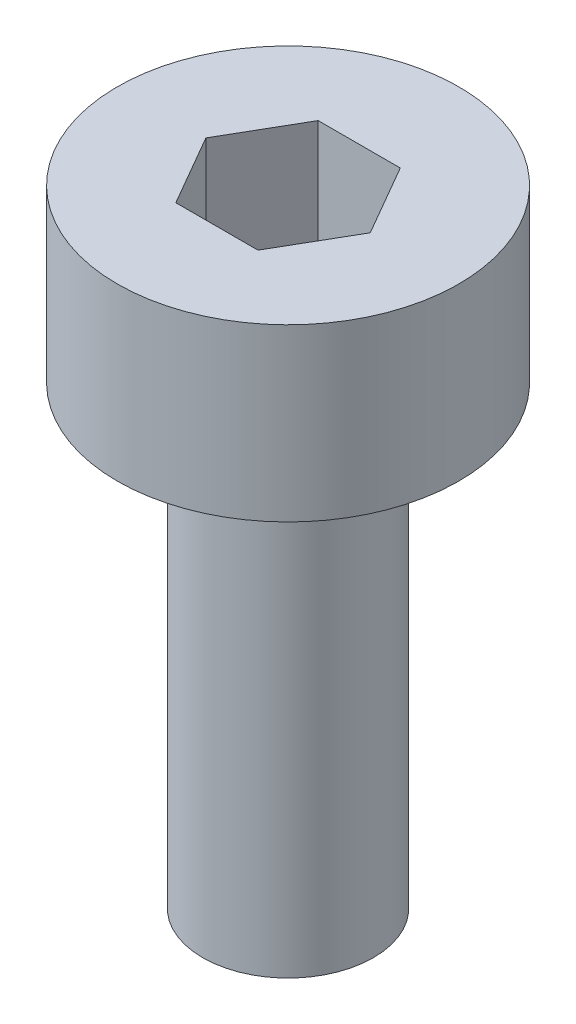
ISO-10303-21;
HEADER;
FILE_DESCRIPTION(('STEP AP214'),'2;1');
FILE_NAME('part.step','',(''),(''),'','','');
FILE_SCHEMA(('AUTOMOTIVE_DESIGN { 1 0 10303 214 1 1 1 1 }'));
ENDSEC;
DATA;
#1=APPLICATION_CONTEXT('core data for automotive mechanical design processes');
#2=APPLICATION_PROTOCOL_DEFINITION('international standard','automotive_design',2000,#1);
#3=PRODUCT_CONTEXT('',#1,'mechanical');
#4=PRODUCT('Part','Part','',(#3));
#5=PRODUCT_RELATED_PRODUCT_CATEGORY('part','',(#4));
#6=PRODUCT_DEFINITION_FORMATION('','',#4);
#7=PRODUCT_DEFINITION_CONTEXT('part definition',#1,'design');
#8=PRODUCT_DEFINITION('design','',#6,#7);
#9=PRODUCT_DEFINITION_SHAPE('','',#8);
#10=(LENGTH_UNIT() NAMED_UNIT(*) SI_UNIT(.MILLI.,.METRE.));
#11=(NAMED_UNIT(*) PLANE_ANGLE_UNIT() SI_UNIT($,.RADIAN.));
#12=(NAMED_UNIT(*) SI_UNIT($,.STERADIAN.) SOLID_ANGLE_UNIT());
#13=UNCERTAINTY_MEASURE_WITH_UNIT(LENGTH_MEASURE(1.E-05),#10,'distance_accuracy_value','');
#14=(GEOMETRIC_REPRESENTATION_CONTEXT(3) GLOBAL_UNCERTAINTY_ASSIGNED_CONTEXT((#13)) GLOBAL_UNIT_ASSIGNED_CONTEXT((#10,
#11,#12)) REPRESENTATION_CONTEXT('',''));
#15=CARTESIAN_POINT('',(0.,0.,0.));
#16=DIRECTION('',(0.,0.,1.));
#17=DIRECTION('',(1.,0.,0.));
#18=AXIS2_PLACEMENT_3D('',#15,#16,#17);
#19=CARTESIAN_POINT('',(0.,8.,0.));
#20=DIRECTION('',(0.,-1.,0.));
#21=DIRECTION('',(0.,0.,-1.));
#22=AXIS2_PLACEMENT_3D('',#19,#20,#21);
#23=CYLINDRICAL_SURFACE('',#22,1.5);
#24=CARTESIAN_POINT('',(0.,8.,0.));
#25=DIRECTION('',(0.,1.,0.));
#26=DIRECTION('',(0.,0.,1.));
#27=AXIS2_PLACEMENT_3D('',#24,#25,#26);
#28=CIRCLE('',#27,1.5);
#29=CARTESIAN_POINT('',(0.,8.,1.5));
#30=VERTEX_POINT('',#29);
#31=EDGE_CURVE('E11',#30,#30,#28,.T.);
#32=ORIENTED_EDGE('',*,*,#31,.F.);
#33=EDGE_LOOP('',(#32));
#34=FACE_BOUND('',#33,.T.);
#35=CARTESIAN_POINT('',(0.,0.,0.));
#36=DIRECTION('',(0.,1.,0.));
#37=DIRECTION('',(0.,0.,1.));
#38=AXIS2_PLACEMENT_3D('',#35,#36,#37);
#39=CIRCLE('',#38,1.5);
#40=CARTESIAN_POINT('',(0.,0.,1.5));
#41=VERTEX_POINT('',#40);
#42=EDGE_CURVE('E35',#41,#41,#39,.T.);
#43=ORIENTED_EDGE('',*,*,#42,.T.);
#44=EDGE_LOOP('',(#43));
#45=FACE_BOUND('',#44,.T.);
#46=ADVANCED_FACE('F32',(#34,#45),#23,.T.);
#47=CARTESIAN_POINT('',(0.,0.,0.));
#48=DIRECTION('',(0.,1.,0.));
#49=DIRECTION('',(0.,0.,1.));
#50=AXIS2_PLACEMENT_3D('',#47,#48,#49);
#51=PLANE('',#50);
#52=ORIENTED_EDGE('',*,*,#42,.F.);
#53=EDGE_LOOP('',(#52));
#54=FACE_BOUND('',#53,.T.);
#55=ADVANCED_FACE('F163',(#54),#51,.F.);
#56=CARTESIAN_POINT('',(0.,11.,0.));
#57=DIRECTION('',(0.,-1.,0.));
#58=DIRECTION('',(0.,0.,-1.));
#59=AXIS2_PLACEMENT_3D('',#56,#57,#58);
#60=CYLINDRICAL_SURFACE('',#59,3.);
#61=CARTESIAN_POINT('',(0.,11.,0.));
#62=DIRECTION('',(0.,1.,0.));
#63=DIRECTION('',(0.,0.,1.));
#64=AXIS2_PLACEMENT_3D('',#61,#62,#63);
#65=CIRCLE('',#64,3.);
#66=CARTESIAN_POINT('',(0.,11.,3.));
#67=VERTEX_POINT('',#66);
#68=EDGE_CURVE('E139',#67,#67,#65,.T.);
#69=ORIENTED_EDGE('',*,*,#68,.F.);
#70=EDGE_LOOP('',(#69));
#71=FACE_BOUND('',#70,.T.);
#72=CARTESIAN_POINT('',(0.,8.,0.));
#73=DIRECTION('',(0.,1.,0.));
#74=DIRECTION('',(0.,0.,1.));
#75=AXIS2_PLACEMENT_3D('',#72,#73,#74);
#76=CIRCLE('',#75,3.);
#77=CARTESIAN_POINT('',(0.,8.,3.));
#78=VERTEX_POINT('',#77);
#79=EDGE_CURVE('E133',#78,#78,#76,.T.);
#80=ORIENTED_EDGE('',*,*,#79,.T.);
#81=EDGE_LOOP('',(#80));
#82=FACE_BOUND('',#81,.T.);
#83=ADVANCED_FACE('F145',(#71,#82),#60,.T.);
#84=CARTESIAN_POINT('',(0.,11.,0.));
#85=DIRECTION('',(0.,1.,0.));
#86=DIRECTION('',(0.,0.,1.));
#87=AXIS2_PLACEMENT_3D('',#84,#85,#86);
#88=PLANE('',#87);
#89=DIRECTION('',(0.5,0.,-0.866025403784439));
#90=VECTOR('',#89,1.);
#91=CARTESIAN_POINT('',(0.721687836487032,11.,1.25));
#92=LINE('',#91,#90);
#93=CARTESIAN_POINT('',(0.721687836487032,11.,1.25));
#94=VERTEX_POINT('',#93);
#95=CARTESIAN_POINT('',(1.44337567297406,11.,0.));
#96=VERTEX_POINT('',#95);
#97=EDGE_CURVE('E46',#94,#96,#92,.T.);
#98=ORIENTED_EDGE('',*,*,#97,.F.);
#99=DIRECTION('',(1.,0.,0.));
#100=VECTOR('',#99,1.);
#101=CARTESIAN_POINT('',(-0.721687836487033,11.,1.25));
#102=LINE('',#101,#100);
#103=CARTESIAN_POINT('',(-0.721687836487033,11.,1.25));
#104=VERTEX_POINT('',#103);
#105=EDGE_CURVE('E129',#104,#94,#102,.T.);
#106=ORIENTED_EDGE('',*,*,#105,.F.);
#107=DIRECTION('',(0.5,0.,0.866025403784439));
#108=VECTOR('',#107,1.);
#109=CARTESIAN_POINT('',(-1.44337567297406,11.,0.));
#110=LINE('',#109,#108);
#111=CARTESIAN_POINT('',(-1.44337567297406,11.,0.));
#112=VERTEX_POINT('',#111);
#113=EDGE_CURVE('E127',#112,#104,#110,.T.);
#114=ORIENTED_EDGE('',*,*,#113,.F.);
#115=DIRECTION('',(-0.5,0.,0.866025403784438));
#116=VECTOR('',#115,1.);
#117=CARTESIAN_POINT('',(-0.721687836487032,11.,-1.25));
#118=LINE('',#117,#116);
#119=CARTESIAN_POINT('',(-0.721687836487032,11.,-1.25));
#120=VERTEX_POINT('',#119);
#121=EDGE_CURVE('E94',#120,#112,#118,.T.);
#122=ORIENTED_EDGE('',*,*,#121,.F.);
#123=DIRECTION('',(-1.,0.,0.));
#124=VECTOR('',#123,1.);
#125=CARTESIAN_POINT('',(0.721687836487032,11.,-1.25));
#126=LINE('',#125,#124);
#127=CARTESIAN_POINT('',(0.721687836487032,11.,-1.25));
#128=VERTEX_POINT('',#127);
#129=EDGE_CURVE('E123',#128,#120,#126,.T.);
#130=ORIENTED_EDGE('',*,*,#129,.F.);
#131=DIRECTION('',(-0.5,0.,-0.866025403784439));
#132=VECTOR('',#131,1.);
#133=CARTESIAN_POINT('',(1.44337567297406,11.,0.));
#134=LINE('',#133,#132);
#135=EDGE_CURVE('E120',#96,#128,#134,.T.);
#136=ORIENTED_EDGE('',*,*,#135,.F.);
#137=EDGE_LOOP('',(#98,#106,#114,#122,#130,#136));
#138=FACE_BOUND('',#137,.T.);
#139=ORIENTED_EDGE('',*,*,#68,.T.);
#140=EDGE_LOOP('',(#139));
#141=FACE_BOUND('',#140,.T.);
#142=ADVANCED_FACE('F150',(#138,#141),#88,.T.);
#143=CARTESIAN_POINT('',(0.,8.,0.));
#144=DIRECTION('',(0.,1.,0.));
#145=DIRECTION('',(0.,0.,1.));
#146=AXIS2_PLACEMENT_3D('',#143,#144,#145);
#147=PLANE('',#146);
#148=ORIENTED_EDGE('',*,*,#31,.T.);
#149=EDGE_LOOP('',(#148));
#150=FACE_BOUND('',#149,.T.);
#151=ORIENTED_EDGE('',*,*,#79,.F.);
#152=EDGE_LOOP('',(#151));
#153=FACE_BOUND('',#152,.T.);
#154=ADVANCED_FACE('F147',(#150,#153),#147,.F.);
#155=CARTESIAN_POINT('',(0.721687836487032,9.,1.25));
#156=DIRECTION('',(0.866025403784439,0.,0.5));
#157=DIRECTION('',(0.5,0.,-0.866025403784439));
#158=AXIS2_PLACEMENT_3D('',#155,#156,#157);
#159=PLANE('',#158);
#160=ORIENTED_EDGE('',*,*,#97,.T.);
#161=DIRECTION('',(0.,1.,0.));
#162=VECTOR('',#161,1.);
#163=CARTESIAN_POINT('',(1.44337567297406,9.,0.));
#164=LINE('',#163,#162);
#165=CARTESIAN_POINT('',(1.44337567297406,9.,0.));
#166=VERTEX_POINT('',#165);
#167=EDGE_CURVE('E76',#166,#96,#164,.T.);
#168=ORIENTED_EDGE('',*,*,#167,.F.);
#169=DIRECTION('',(0.5,0.,-0.866025403784439));
#170=VECTOR('',#169,1.);
#171=CARTESIAN_POINT('',(0.721687836487032,9.,1.25));
#172=LINE('',#171,#170);
#173=CARTESIAN_POINT('',(0.721687836487032,9.,1.25));
#174=VERTEX_POINT('',#173);
#175=EDGE_CURVE('E131',#174,#166,#172,.T.);
#176=ORIENTED_EDGE('',*,*,#175,.F.);
#177=DIRECTION('',(0.,1.,0.));
#178=VECTOR('',#177,1.);
#179=CARTESIAN_POINT('',(0.721687836487032,9.,1.25));
#180=LINE('',#179,#178);
#181=EDGE_CURVE('E54',#174,#94,#180,.T.);
#182=ORIENTED_EDGE('',*,*,#181,.T.);
#183=EDGE_LOOP('',(#160,#168,#176,#182));
#184=FACE_BOUND('',#183,.T.);
#185=ADVANCED_FACE('F149',(#184),#159,.F.);
#186=CARTESIAN_POINT('',(-0.721687836487033,9.,1.25));
#187=DIRECTION('',(0.,0.,1.));
#188=DIRECTION('',(1.,0.,0.));
#189=AXIS2_PLACEMENT_3D('',#186,#187,#188);
#190=PLANE('',#189);
#191=ORIENTED_EDGE('',*,*,#105,.T.);
#192=ORIENTED_EDGE('',*,*,#181,.F.);
#193=DIRECTION('',(1.,0.,0.));
#194=VECTOR('',#193,1.);
#195=CARTESIAN_POINT('',(-0.721687836487033,9.,1.25));
#196=LINE('',#195,#194);
#197=CARTESIAN_POINT('',(-0.721687836487033,9.,1.25));
#198=VERTEX_POINT('',#197);
#199=EDGE_CURVE('E106',#198,#174,#196,.T.);
#200=ORIENTED_EDGE('',*,*,#199,.F.);
#201=DIRECTION('',(0.,1.,0.));
#202=VECTOR('',#201,1.);
#203=CARTESIAN_POINT('',(-0.721687836487033,9.,1.25));
#204=LINE('',#203,#202);
#205=EDGE_CURVE('E98',#198,#104,#204,.T.);
#206=ORIENTED_EDGE('',*,*,#205,.T.);
#207=EDGE_LOOP('',(#191,#192,#200,#206));
#208=FACE_BOUND('',#207,.T.);
#209=ADVANCED_FACE('F157',(#208),#190,.F.);
#210=CARTESIAN_POINT('',(-1.44337567297406,9.,0.));
#211=DIRECTION('',(-0.866025403784439,0.,0.5));
#212=DIRECTION('',(0.5,0.,0.866025403784439));
#213=AXIS2_PLACEMENT_3D('',#210,#211,#212);
#214=PLANE('',#213);
#215=ORIENTED_EDGE('',*,*,#113,.T.);
#216=ORIENTED_EDGE('',*,*,#205,.F.);
#217=DIRECTION('',(0.5,0.,0.866025403784439));
#218=VECTOR('',#217,1.);
#219=CARTESIAN_POINT('',(-1.44337567297406,9.,0.));
#220=LINE('',#219,#218);
#221=CARTESIAN_POINT('',(-1.44337567297406,9.,0.));
#222=VERTEX_POINT('',#221);
#223=EDGE_CURVE('E102',#222,#198,#220,.T.);
#224=ORIENTED_EDGE('',*,*,#223,.F.);
#225=DIRECTION('',(0.,1.,0.));
#226=VECTOR('',#225,1.);
#227=CARTESIAN_POINT('',(-1.44337567297406,9.,0.));
#228=LINE('',#227,#226);
#229=EDGE_CURVE('E87',#222,#112,#228,.T.);
#230=ORIENTED_EDGE('',*,*,#229,.T.);
#231=EDGE_LOOP('',(#215,#216,#224,#230));
#232=FACE_BOUND('',#231,.T.);
#233=ADVANCED_FACE('F103',(#232),#214,.F.);
#234=CARTESIAN_POINT('',(-0.721687836487032,9.,-1.25));
#235=DIRECTION('',(-0.866025403784439,0.,-0.5));
#236=DIRECTION('',(-0.5,0.,0.866025403784438));
#237=AXIS2_PLACEMENT_3D('',#234,#235,#236);
#238=PLANE('',#237);
#239=ORIENTED_EDGE('',*,*,#121,.T.);
#240=ORIENTED_EDGE('',*,*,#229,.F.);
#241=DIRECTION('',(-0.5,0.,0.866025403784438));
#242=VECTOR('',#241,1.);
#243=CARTESIAN_POINT('',(-0.721687836487032,9.,-1.25));
#244=LINE('',#243,#242);
#245=CARTESIAN_POINT('',(-0.721687836487032,9.,-1.25));
#246=VERTEX_POINT('',#245);
#247=EDGE_CURVE('E91',#246,#222,#244,.T.);
#248=ORIENTED_EDGE('',*,*,#247,.F.);
#249=DIRECTION('',(0.,1.,0.));
#250=VECTOR('',#249,1.);
#251=CARTESIAN_POINT('',(-0.721687836487032,9.,-1.25));
#252=LINE('',#251,#250);
#253=EDGE_CURVE('E99',#246,#120,#252,.T.);
#254=ORIENTED_EDGE('',*,*,#253,.T.);
#255=EDGE_LOOP('',(#239,#240,#248,#254));
#256=FACE_BOUND('',#255,.T.);
#257=ADVANCED_FACE('F89',(#256),#238,.F.);
#258=CARTESIAN_POINT('',(0.721687836487032,9.,-1.25));
#259=DIRECTION('',(0.,0.,-1.));
#260=DIRECTION('',(-1.,0.,0.));
#261=AXIS2_PLACEMENT_3D('',#258,#259,#260);
#262=PLANE('',#261);
#263=ORIENTED_EDGE('',*,*,#129,.T.);
#264=ORIENTED_EDGE('',*,*,#253,.F.);
#265=DIRECTION('',(-1.,0.,0.));
#266=VECTOR('',#265,1.);
#267=CARTESIAN_POINT('',(0.721687836487032,9.,-1.25));
#268=LINE('',#267,#266);
#269=CARTESIAN_POINT('',(0.721687836487032,9.,-1.25));
#270=VERTEX_POINT('',#269);
#271=EDGE_CURVE('E112',#270,#246,#268,.T.);
#272=ORIENTED_EDGE('',*,*,#271,.F.);
#273=DIRECTION('',(0.,1.,0.));
#274=VECTOR('',#273,1.);
#275=CARTESIAN_POINT('',(0.721687836487032,9.,-1.25));
#276=LINE('',#275,#274);
#277=EDGE_CURVE('E136',#270,#128,#276,.T.);
#278=ORIENTED_EDGE('',*,*,#277,.T.);
#279=EDGE_LOOP('',(#263,#264,#272,#278));
#280=FACE_BOUND('',#279,.T.);
#281=ADVANCED_FACE('F218',(#280),#262,.F.);
#282=CARTESIAN_POINT('',(1.44337567297406,9.,0.));
#283=DIRECTION('',(0.866025403784439,0.,-0.5));
#284=DIRECTION('',(-0.5,0.,-0.866025403784439));
#285=AXIS2_PLACEMENT_3D('',#282,#283,#284);
#286=PLANE('',#285);
#287=ORIENTED_EDGE('',*,*,#135,.T.);
#288=ORIENTED_EDGE('',*,*,#277,.F.);
#289=DIRECTION('',(-0.5,0.,-0.866025403784439));
#290=VECTOR('',#289,1.);
#291=CARTESIAN_POINT('',(1.44337567297406,9.,0.));
#292=LINE('',#291,#290);
#293=EDGE_CURVE('E114',#166,#270,#292,.T.);
#294=ORIENTED_EDGE('',*,*,#293,.F.);
#295=ORIENTED_EDGE('',*,*,#167,.T.);
#296=EDGE_LOOP('',(#287,#288,#294,#295));
#297=FACE_BOUND('',#296,.T.);
#298=ADVANCED_FACE('F227',(#297),#286,.F.);
#299=CARTESIAN_POINT('',(0.,9.,0.));
#300=DIRECTION('',(0.,1.,0.));
#301=DIRECTION('',(0.,0.,1.));
#302=AXIS2_PLACEMENT_3D('',#299,#300,#301);
#303=PLANE('',#302);
#304=ORIENTED_EDGE('',*,*,#175,.T.);
#305=ORIENTED_EDGE('',*,*,#293,.T.);
#306=ORIENTED_EDGE('',*,*,#271,.T.);
#307=ORIENTED_EDGE('',*,*,#247,.T.);
#308=ORIENTED_EDGE('',*,*,#223,.T.);
#309=ORIENTED_EDGE('',*,*,#199,.T.);
#310=EDGE_LOOP('',(#304,#305,#306,#307,#308,#309));
#311=FACE_BOUND('',#310,.T.);
#312=ADVANCED_FACE('F109',(#311),#303,.T.);
#313=CLOSED_SHELL('',(#46,#55,#83,#142,#154,#185,#209,#233,#257,#281,#298,#312));
#314=MANIFOLD_SOLID_BREP('B2',#313);
#315=ADVANCED_BREP_SHAPE_REPRESENTATION('',(#18,#314),#14);
#316=SHAPE_DEFINITION_REPRESENTATION(#9,#315);
ENDSEC;
END-ISO-10303-21;
